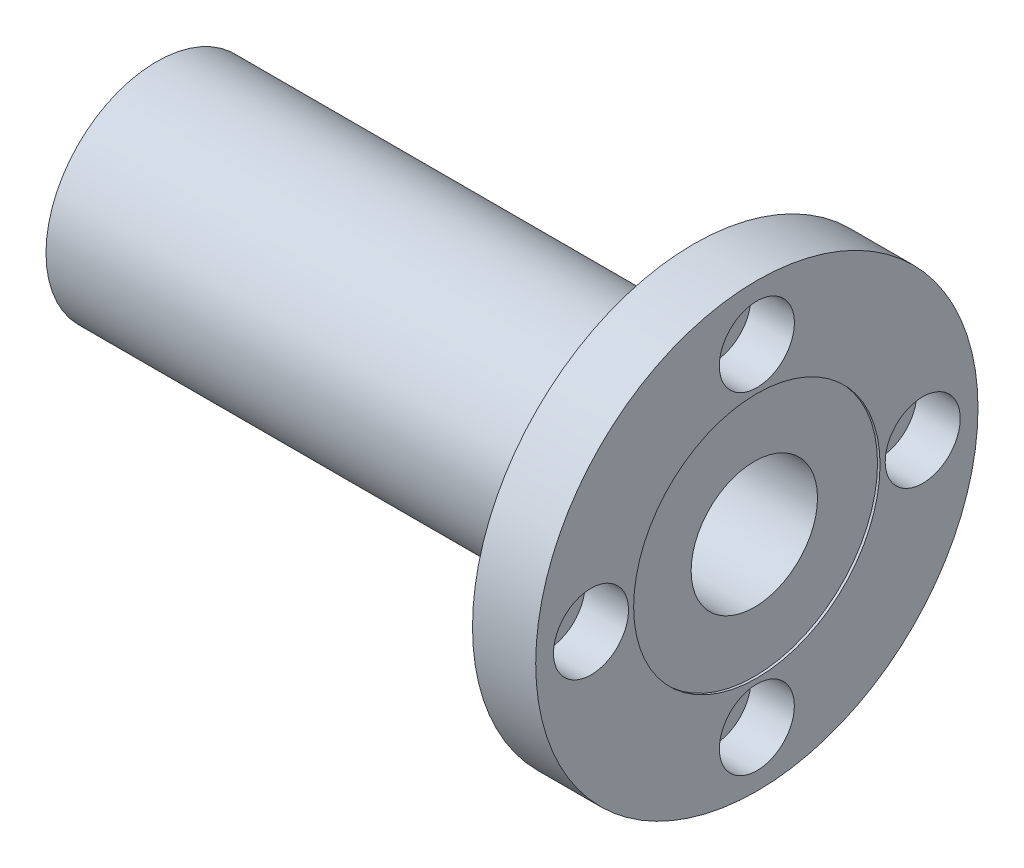
ISO-10303-21;
HEADER;
FILE_DESCRIPTION(('STEP AP214'),'2;1');
FILE_NAME('part.step','',(''),(''),'','','');
FILE_SCHEMA(('AUTOMOTIVE_DESIGN { 1 0 10303 214 1 1 1 1 }'));
ENDSEC;
DATA;
#1=APPLICATION_CONTEXT('core data for automotive mechanical design processes');
#2=APPLICATION_PROTOCOL_DEFINITION('international standard','automotive_design',2000,#1);
#3=PRODUCT_CONTEXT('',#1,'mechanical');
#4=PRODUCT('Part','Part','',(#3));
#5=PRODUCT_RELATED_PRODUCT_CATEGORY('part','',(#4));
#6=PRODUCT_DEFINITION_FORMATION('','',#4);
#7=PRODUCT_DEFINITION_CONTEXT('part definition',#1,'design');
#8=PRODUCT_DEFINITION('design','',#6,#7);
#9=PRODUCT_DEFINITION_SHAPE('','',#8);
#10=(LENGTH_UNIT() NAMED_UNIT(*) SI_UNIT(.MILLI.,.METRE.));
#11=(NAMED_UNIT(*) PLANE_ANGLE_UNIT() SI_UNIT($,.RADIAN.));
#12=(NAMED_UNIT(*) SI_UNIT($,.STERADIAN.) SOLID_ANGLE_UNIT());
#13=UNCERTAINTY_MEASURE_WITH_UNIT(LENGTH_MEASURE(1.E-05),#10,'distance_accuracy_value','');
#14=(GEOMETRIC_REPRESENTATION_CONTEXT(3) GLOBAL_UNCERTAINTY_ASSIGNED_CONTEXT((#13)) GLOBAL_UNIT_ASSIGNED_CONTEXT((#10,
#11,#12)) REPRESENTATION_CONTEXT('',''));
#15=CARTESIAN_POINT('',(0.,0.,0.));
#16=DIRECTION('',(0.,0.,1.));
#17=DIRECTION('',(1.,0.,0.));
#18=AXIS2_PLACEMENT_3D('',#15,#16,#17);
#19=CARTESIAN_POINT('',(-10.3908115950587,0.,0.));
#20=DIRECTION('',(-1.,0.,0.));
#21=DIRECTION('',(0.,0.,1.));
#22=AXIS2_PLACEMENT_3D('',#19,#20,#21);
#23=CYLINDRICAL_SURFACE('',#22,6.35000000000001);
#24=CARTESIAN_POINT('',(-30.1625,0.,0.));
#25=DIRECTION('',(-1.,0.,0.));
#26=DIRECTION('',(0.,0.,1.));
#27=AXIS2_PLACEMENT_3D('',#24,#25,#26);
#28=CIRCLE('',#27,6.35000000000001);
#29=CARTESIAN_POINT('',(-30.1625,0.,6.35000000000001));
#30=VERTEX_POINT('',#29);
#31=EDGE_CURVE('E51',#30,#30,#28,.T.);
#32=ORIENTED_EDGE('',*,*,#31,.T.);
#33=EDGE_LOOP('',(#32));
#34=FACE_BOUND('',#33,.T.);
#35=CARTESIAN_POINT('',(29.9085,0.,0.));
#36=DIRECTION('',(1.,0.,0.));
#37=DIRECTION('',(0.,0.,-1.));
#38=AXIS2_PLACEMENT_3D('',#35,#36,#37);
#39=CIRCLE('',#38,6.35000000000001);
#40=CARTESIAN_POINT('',(29.9085,0.,-6.35000000000001));
#41=VERTEX_POINT('',#40);
#42=EDGE_CURVE('E35',#41,#41,#39,.T.);
#43=ORIENTED_EDGE('',*,*,#42,.T.);
#44=EDGE_LOOP('',(#43));
#45=FACE_BOUND('',#44,.T.);
#46=ADVANCED_FACE('F31',(#34,#45),#23,.F.);
#47=CARTESIAN_POINT('',(-30.1625,-6.35000000000001,0.));
#48=DIRECTION('',(-1.,0.,0.));
#49=DIRECTION('',(0.,0.,1.));
#50=AXIS2_PLACEMENT_3D('',#47,#48,#49);
#51=PLANE('',#50);
#52=CARTESIAN_POINT('',(-30.1625,0.,0.));
#53=DIRECTION('',(-1.,0.,0.));
#54=DIRECTION('',(0.,0.,1.));
#55=AXIS2_PLACEMENT_3D('',#52,#53,#54);
#56=CIRCLE('',#55,11.1125);
#57=CARTESIAN_POINT('',(-30.1625,0.,11.1125));
#58=VERTEX_POINT('',#57);
#59=EDGE_CURVE('E10',#58,#58,#56,.T.);
#60=ORIENTED_EDGE('',*,*,#59,.T.);
#61=EDGE_LOOP('',(#60));
#62=FACE_BOUND('',#61,.T.);
#63=ORIENTED_EDGE('',*,*,#31,.F.);
#64=EDGE_LOOP('',(#63));
#65=FACE_BOUND('',#64,.T.);
#66=ADVANCED_FACE('F33',(#62,#65),#51,.T.);
#67=CARTESIAN_POINT('',(-10.3908115950587,0.,0.));
#68=DIRECTION('',(-1.,0.,0.));
#69=DIRECTION('',(0.,0.,1.));
#70=AXIS2_PLACEMENT_3D('',#67,#68,#69);
#71=CYLINDRICAL_SURFACE('',#70,11.1125);
#72=CARTESIAN_POINT('',(23.8125,0.,0.));
#73=DIRECTION('',(-1.,0.,0.));
#74=DIRECTION('',(0.,0.,1.));
#75=AXIS2_PLACEMENT_3D('',#72,#73,#74);
#76=CIRCLE('',#75,11.1125);
#77=CARTESIAN_POINT('',(23.8125,0.,11.1125));
#78=VERTEX_POINT('',#77);
#79=EDGE_CURVE('E39',#78,#78,#76,.T.);
#80=ORIENTED_EDGE('',*,*,#79,.T.);
#81=EDGE_LOOP('',(#80));
#82=FACE_BOUND('',#81,.T.);
#83=ORIENTED_EDGE('',*,*,#59,.F.);
#84=EDGE_LOOP('',(#83));
#85=FACE_BOUND('',#84,.T.);
#86=ADVANCED_FACE('F129',(#82,#85),#71,.T.);
#87=CARTESIAN_POINT('',(23.8125,-11.1125,0.));
#88=DIRECTION('',(-1.,0.,0.));
#89=DIRECTION('',(0.,0.,1.));
#90=AXIS2_PLACEMENT_3D('',#87,#88,#89);
#91=PLANE('',#90);
#92=CARTESIAN_POINT('',(23.8125,1.74595888700524E-13,-16.66875));
#93=DIRECTION('',(-1.,0.,0.));
#94=DIRECTION('',(0.,1.,0.));
#95=AXIS2_PLACEMENT_3D('',#92,#93,#94);
#96=CIRCLE('',#95,2.38125);
#97=CARTESIAN_POINT('',(23.8125,2.38125000000018,-16.66875));
#98=VERTEX_POINT('',#97);
#99=EDGE_CURVE('E90',#98,#98,#96,.T.);
#100=ORIENTED_EDGE('',*,*,#99,.F.);
#101=EDGE_LOOP('',(#100));
#102=FACE_BOUND('',#101,.T.);
#103=CARTESIAN_POINT('',(23.8125,-16.66875,-1.16397259133683E-13));
#104=DIRECTION('',(-1.,0.,0.));
#105=DIRECTION('',(0.,0.,-1.));
#106=AXIS2_PLACEMENT_3D('',#103,#104,#105);
#107=CIRCLE('',#106,2.38125);
#108=CARTESIAN_POINT('',(23.8125,-16.66875,-2.38125000000012));
#109=VERTEX_POINT('',#108);
#110=EDGE_CURVE('E78',#109,#109,#107,.T.);
#111=ORIENTED_EDGE('',*,*,#110,.F.);
#112=EDGE_LOOP('',(#111));
#113=FACE_BOUND('',#112,.T.);
#114=CARTESIAN_POINT('',(23.8125,0.,16.66875));
#115=DIRECTION('',(-1.,0.,0.));
#116=DIRECTION('',(0.,-1.,0.));
#117=AXIS2_PLACEMENT_3D('',#114,#115,#116);
#118=CIRCLE('',#117,2.38125);
#119=CARTESIAN_POINT('',(23.8125,-2.38125000000006,16.66875));
#120=VERTEX_POINT('',#119);
#121=EDGE_CURVE('E66',#120,#120,#118,.T.);
#122=ORIENTED_EDGE('',*,*,#121,.F.);
#123=EDGE_LOOP('',(#122));
#124=FACE_BOUND('',#123,.T.);
#125=CARTESIAN_POINT('',(23.8125,16.66875,0.));
#126=DIRECTION('',(-1.,0.,0.));
#127=DIRECTION('',(0.,0.,1.));
#128=AXIS2_PLACEMENT_3D('',#125,#126,#127);
#129=CIRCLE('',#128,2.38125);
#130=CARTESIAN_POINT('',(23.8125,16.66875,2.38125));
#131=VERTEX_POINT('',#130);
#132=EDGE_CURVE('E54',#131,#131,#129,.T.);
#133=ORIENTED_EDGE('',*,*,#132,.F.);
#134=EDGE_LOOP('',(#133));
#135=FACE_BOUND('',#134,.T.);
#136=CARTESIAN_POINT('',(23.8125,0.,0.));
#137=DIRECTION('',(-1.,0.,0.));
#138=DIRECTION('',(0.,0.,1.));
#139=AXIS2_PLACEMENT_3D('',#136,#137,#138);
#140=CIRCLE('',#139,22.225);
#141=CARTESIAN_POINT('',(23.8125,0.,22.225));
#142=VERTEX_POINT('',#141);
#143=EDGE_CURVE('E43',#142,#142,#140,.T.);
#144=ORIENTED_EDGE('',*,*,#143,.T.);
#145=EDGE_LOOP('',(#144));
#146=FACE_BOUND('',#145,.T.);
#147=ORIENTED_EDGE('',*,*,#79,.F.);
#148=EDGE_LOOP('',(#147));
#149=FACE_BOUND('',#148,.T.);
#150=ADVANCED_FACE('F141',(#102,#113,#124,#135,#146,#149),#91,.T.);
#151=CARTESIAN_POINT('',(-10.3908115950587,0.,0.));
#152=DIRECTION('',(-1.,0.,0.));
#153=DIRECTION('',(0.,0.,1.));
#154=AXIS2_PLACEMENT_3D('',#151,#152,#153);
#155=CYLINDRICAL_SURFACE('',#154,22.225);
#156=CARTESIAN_POINT('',(30.1625,0.,0.));
#157=DIRECTION('',(-1.,0.,0.));
#158=DIRECTION('',(0.,0.,1.));
#159=AXIS2_PLACEMENT_3D('',#156,#157,#158);
#160=CIRCLE('',#159,22.225);
#161=CARTESIAN_POINT('',(30.1625,0.,22.225));
#162=VERTEX_POINT('',#161);
#163=EDGE_CURVE('E48',#162,#162,#160,.T.);
#164=ORIENTED_EDGE('',*,*,#163,.T.);
#165=EDGE_LOOP('',(#164));
#166=FACE_BOUND('',#165,.T.);
#167=ORIENTED_EDGE('',*,*,#143,.F.);
#168=EDGE_LOOP('',(#167));
#169=FACE_BOUND('',#168,.T.);
#170=ADVANCED_FACE('F137',(#166,#169),#155,.T.);
#171=CARTESIAN_POINT('',(30.1625,-22.225,0.));
#172=DIRECTION('',(1.,0.,0.));
#173=DIRECTION('',(0.,0.,-1.));
#174=AXIS2_PLACEMENT_3D('',#171,#172,#173);
#175=PLANE('',#174);
#176=CARTESIAN_POINT('',(30.1625,0.,0.));
#177=DIRECTION('',(1.,0.,0.));
#178=DIRECTION('',(0.,0.,-1.));
#179=AXIS2_PLACEMENT_3D('',#176,#177,#178);
#180=CIRCLE('',#179,12.3825);
#181=CARTESIAN_POINT('',(30.1625,0.,-12.3825));
#182=VERTEX_POINT('',#181);
#183=EDGE_CURVE('E102',#182,#182,#180,.T.);
#184=ORIENTED_EDGE('',*,*,#183,.F.);
#185=EDGE_LOOP('',(#184));
#186=FACE_BOUND('',#185,.T.);
#187=CARTESIAN_POINT('',(30.1625,1.74595888700524E-13,-16.66875));
#188=DIRECTION('',(-1.,0.,0.));
#189=DIRECTION('',(0.,1.,0.));
#190=AXIS2_PLACEMENT_3D('',#187,#188,#189);
#191=CIRCLE('',#190,3.77063);
#192=CARTESIAN_POINT('',(30.1625,3.77063000000017,-16.66875));
#193=VERTEX_POINT('',#192);
#194=EDGE_CURVE('E99',#193,#193,#191,.T.);
#195=ORIENTED_EDGE('',*,*,#194,.T.);
#196=EDGE_LOOP('',(#195));
#197=FACE_BOUND('',#196,.T.);
#198=CARTESIAN_POINT('',(30.1625,-16.66875,-1.16397259133683E-13));
#199=DIRECTION('',(-1.,0.,0.));
#200=DIRECTION('',(0.,0.,-1.));
#201=AXIS2_PLACEMENT_3D('',#198,#199,#200);
#202=CIRCLE('',#201,3.77063);
#203=CARTESIAN_POINT('',(30.1625,-16.66875,-3.77063000000011));
#204=VERTEX_POINT('',#203);
#205=EDGE_CURVE('E87',#204,#204,#202,.T.);
#206=ORIENTED_EDGE('',*,*,#205,.T.);
#207=EDGE_LOOP('',(#206));
#208=FACE_BOUND('',#207,.T.);
#209=CARTESIAN_POINT('',(30.1625,0.,16.66875));
#210=DIRECTION('',(-1.,0.,0.));
#211=DIRECTION('',(0.,-1.,0.));
#212=AXIS2_PLACEMENT_3D('',#209,#210,#211);
#213=CIRCLE('',#212,3.77063);
#214=CARTESIAN_POINT('',(30.1625,-3.77063000000006,16.66875));
#215=VERTEX_POINT('',#214);
#216=EDGE_CURVE('E75',#215,#215,#213,.T.);
#217=ORIENTED_EDGE('',*,*,#216,.T.);
#218=EDGE_LOOP('',(#217));
#219=FACE_BOUND('',#218,.T.);
#220=CARTESIAN_POINT('',(30.1625,16.66875,0.));
#221=DIRECTION('',(-1.,0.,0.));
#222=DIRECTION('',(0.,0.,1.));
#223=AXIS2_PLACEMENT_3D('',#220,#221,#222);
#224=CIRCLE('',#223,3.77063);
#225=CARTESIAN_POINT('',(30.1625,16.66875,3.77063));
#226=VERTEX_POINT('',#225);
#227=EDGE_CURVE('E63',#226,#226,#224,.T.);
#228=ORIENTED_EDGE('',*,*,#227,.T.);
#229=EDGE_LOOP('',(#228));
#230=FACE_BOUND('',#229,.T.);
#231=ORIENTED_EDGE('',*,*,#163,.F.);
#232=EDGE_LOOP('',(#231));
#233=FACE_BOUND('',#232,.T.);
#234=ADVANCED_FACE('F134',(#186,#197,#208,#219,#230,#233),#175,.T.);
#235=CARTESIAN_POINT('',(7.20532024776216,16.66875,0.));
#236=DIRECTION('',(-1.,0.,0.));
#237=DIRECTION('',(0.,0.,1.));
#238=AXIS2_PLACEMENT_3D('',#235,#236,#237);
#239=CYLINDRICAL_SURFACE('',#238,2.38125);
#240=ORIENTED_EDGE('',*,*,#132,.T.);
#241=EDGE_LOOP('',(#240));
#242=FACE_BOUND('',#241,.T.);
#243=CARTESIAN_POINT('',(25.79624,16.66875,0.));
#244=DIRECTION('',(-1.,0.,0.));
#245=DIRECTION('',(0.,0.,1.));
#246=AXIS2_PLACEMENT_3D('',#243,#244,#245);
#247=CIRCLE('',#246,2.38125);
#248=CARTESIAN_POINT('',(25.79624,16.66875,2.38125));
#249=VERTEX_POINT('',#248);
#250=EDGE_CURVE('E57',#249,#249,#247,.T.);
#251=ORIENTED_EDGE('',*,*,#250,.F.);
#252=EDGE_LOOP('',(#251));
#253=FACE_BOUND('',#252,.T.);
#254=ADVANCED_FACE('F132',(#242,#253),#239,.F.);
#255=CARTESIAN_POINT('',(25.79624,20.43938,0.));
#256=DIRECTION('',(1.,0.,0.));
#257=DIRECTION('',(0.,0.,-1.));
#258=AXIS2_PLACEMENT_3D('',#255,#256,#257);
#259=PLANE('',#258);
#260=ORIENTED_EDGE('',*,*,#250,.T.);
#261=EDGE_LOOP('',(#260));
#262=FACE_BOUND('',#261,.T.);
#263=CARTESIAN_POINT('',(25.79624,16.66875,0.));
#264=DIRECTION('',(-1.,0.,0.));
#265=DIRECTION('',(0.,0.,1.));
#266=AXIS2_PLACEMENT_3D('',#263,#264,#265);
#267=CIRCLE('',#266,3.77063);
#268=CARTESIAN_POINT('',(25.79624,16.66875,3.77063));
#269=VERTEX_POINT('',#268);
#270=EDGE_CURVE('E60',#269,#269,#267,.T.);
#271=ORIENTED_EDGE('',*,*,#270,.F.);
#272=EDGE_LOOP('',(#271));
#273=FACE_BOUND('',#272,.T.);
#274=ADVANCED_FACE('F175',(#262,#273),#259,.T.);
#275=CARTESIAN_POINT('',(7.20532024776216,16.66875,0.));
#276=DIRECTION('',(-1.,0.,0.));
#277=DIRECTION('',(0.,0.,1.));
#278=AXIS2_PLACEMENT_3D('',#275,#276,#277);
#279=CYLINDRICAL_SURFACE('',#278,3.77063);
#280=ORIENTED_EDGE('',*,*,#270,.T.);
#281=EDGE_LOOP('',(#280));
#282=FACE_BOUND('',#281,.T.);
#283=ORIENTED_EDGE('',*,*,#227,.F.);
#284=EDGE_LOOP('',(#283));
#285=FACE_BOUND('',#284,.T.);
#286=ADVANCED_FACE('F182',(#282,#285),#279,.F.);
#287=CARTESIAN_POINT('',(7.20532024776216,0.,16.66875));
#288=DIRECTION('',(-1.,0.,0.));
#289=DIRECTION('',(0.,-1.,0.));
#290=AXIS2_PLACEMENT_3D('',#287,#288,#289);
#291=CYLINDRICAL_SURFACE('',#290,2.38125);
#292=ORIENTED_EDGE('',*,*,#121,.T.);
#293=EDGE_LOOP('',(#292));
#294=FACE_BOUND('',#293,.T.);
#295=CARTESIAN_POINT('',(25.79624,0.,16.66875));
#296=DIRECTION('',(-1.,0.,0.));
#297=DIRECTION('',(0.,-1.,0.));
#298=AXIS2_PLACEMENT_3D('',#295,#296,#297);
#299=CIRCLE('',#298,2.38125);
#300=CARTESIAN_POINT('',(25.79624,-2.38125000000006,16.66875));
#301=VERTEX_POINT('',#300);
#302=EDGE_CURVE('E69',#301,#301,#299,.T.);
#303=ORIENTED_EDGE('',*,*,#302,.F.);
#304=EDGE_LOOP('',(#303));
#305=FACE_BOUND('',#304,.T.);
#306=ADVANCED_FACE('F188',(#294,#305),#291,.F.);
#307=CARTESIAN_POINT('',(25.79624,0.,20.43938));
#308=DIRECTION('',(1.,0.,0.));
#309=DIRECTION('',(0.,1.,0.));
#310=AXIS2_PLACEMENT_3D('',#307,#308,#309);
#311=PLANE('',#310);
#312=ORIENTED_EDGE('',*,*,#302,.T.);
#313=EDGE_LOOP('',(#312));
#314=FACE_BOUND('',#313,.T.);
#315=CARTESIAN_POINT('',(25.79624,0.,16.66875));
#316=DIRECTION('',(-1.,0.,0.));
#317=DIRECTION('',(0.,-1.,0.));
#318=AXIS2_PLACEMENT_3D('',#315,#316,#317);
#319=CIRCLE('',#318,3.77063);
#320=CARTESIAN_POINT('',(25.79624,-3.77063000000006,16.66875));
#321=VERTEX_POINT('',#320);
#322=EDGE_CURVE('E72',#321,#321,#319,.T.);
#323=ORIENTED_EDGE('',*,*,#322,.F.);
#324=EDGE_LOOP('',(#323));
#325=FACE_BOUND('',#324,.T.);
#326=ADVANCED_FACE('F195',(#314,#325),#311,.T.);
#327=CARTESIAN_POINT('',(7.20532024776216,0.,16.66875));
#328=DIRECTION('',(-1.,0.,0.));
#329=DIRECTION('',(0.,-1.,0.));
#330=AXIS2_PLACEMENT_3D('',#327,#328,#329);
#331=CYLINDRICAL_SURFACE('',#330,3.77063);
#332=ORIENTED_EDGE('',*,*,#322,.T.);
#333=EDGE_LOOP('',(#332));
#334=FACE_BOUND('',#333,.T.);
#335=ORIENTED_EDGE('',*,*,#216,.F.);
#336=EDGE_LOOP('',(#335));
#337=FACE_BOUND('',#336,.T.);
#338=ADVANCED_FACE('F203',(#334,#337),#331,.F.);
#339=CARTESIAN_POINT('',(7.20532024776216,-16.66875,-1.16397259133683E-13));
#340=DIRECTION('',(-1.,0.,0.));
#341=DIRECTION('',(0.,0.,-1.));
#342=AXIS2_PLACEMENT_3D('',#339,#340,#341);
#343=CYLINDRICAL_SURFACE('',#342,2.38125);
#344=ORIENTED_EDGE('',*,*,#110,.T.);
#345=EDGE_LOOP('',(#344));
#346=FACE_BOUND('',#345,.T.);
#347=CARTESIAN_POINT('',(25.79624,-16.66875,-1.16397259133683E-13));
#348=DIRECTION('',(-1.,0.,0.));
#349=DIRECTION('',(0.,0.,-1.));
#350=AXIS2_PLACEMENT_3D('',#347,#348,#349);
#351=CIRCLE('',#350,2.38125);
#352=CARTESIAN_POINT('',(25.79624,-16.66875,-2.38125000000012));
#353=VERTEX_POINT('',#352);
#354=EDGE_CURVE('E81',#353,#353,#351,.T.);
#355=ORIENTED_EDGE('',*,*,#354,.F.);
#356=EDGE_LOOP('',(#355));
#357=FACE_BOUND('',#356,.T.);
#358=ADVANCED_FACE('F211',(#346,#357),#343,.F.);
#359=CARTESIAN_POINT('',(25.79624,-20.43938,-1.42727427695047E-13));
#360=DIRECTION('',(1.,0.,0.));
#361=DIRECTION('',(0.,0.,1.));
#362=AXIS2_PLACEMENT_3D('',#359,#360,#361);
#363=PLANE('',#362);
#364=ORIENTED_EDGE('',*,*,#354,.T.);
#365=EDGE_LOOP('',(#364));
#366=FACE_BOUND('',#365,.T.);
#367=CARTESIAN_POINT('',(25.79624,-16.66875,-1.16397259133683E-13));
#368=DIRECTION('',(-1.,0.,0.));
#369=DIRECTION('',(0.,0.,-1.));
#370=AXIS2_PLACEMENT_3D('',#367,#368,#369);
#371=CIRCLE('',#370,3.77063);
#372=CARTESIAN_POINT('',(25.79624,-16.66875,-3.77063000000011));
#373=VERTEX_POINT('',#372);
#374=EDGE_CURVE('E84',#373,#373,#371,.T.);
#375=ORIENTED_EDGE('',*,*,#374,.F.);
#376=EDGE_LOOP('',(#375));
#377=FACE_BOUND('',#376,.T.);
#378=ADVANCED_FACE('F219',(#366,#377),#363,.T.);
#379=CARTESIAN_POINT('',(7.20532024776216,-16.66875,-1.16397259133683E-13));
#380=DIRECTION('',(-1.,0.,0.));
#381=DIRECTION('',(0.,0.,-1.));
#382=AXIS2_PLACEMENT_3D('',#379,#380,#381);
#383=CYLINDRICAL_SURFACE('',#382,3.77063);
#384=ORIENTED_EDGE('',*,*,#374,.T.);
#385=EDGE_LOOP('',(#384));
#386=FACE_BOUND('',#385,.T.);
#387=ORIENTED_EDGE('',*,*,#205,.F.);
#388=EDGE_LOOP('',(#387));
#389=FACE_BOUND('',#388,.T.);
#390=ADVANCED_FACE('F227',(#386,#389),#383,.F.);
#391=CARTESIAN_POINT('',(7.20532024776216,1.74595888700524E-13,-16.66875));
#392=DIRECTION('',(-1.,0.,0.));
#393=DIRECTION('',(0.,1.,0.));
#394=AXIS2_PLACEMENT_3D('',#391,#392,#393);
#395=CYLINDRICAL_SURFACE('',#394,2.38125);
#396=ORIENTED_EDGE('',*,*,#99,.T.);
#397=EDGE_LOOP('',(#396));
#398=FACE_BOUND('',#397,.T.);
#399=CARTESIAN_POINT('',(25.79624,1.74595888700524E-13,-16.66875));
#400=DIRECTION('',(-1.,0.,0.));
#401=DIRECTION('',(0.,1.,0.));
#402=AXIS2_PLACEMENT_3D('',#399,#400,#401);
#403=CIRCLE('',#402,2.38125);
#404=CARTESIAN_POINT('',(25.79624,2.38125000000018,-16.66875));
#405=VERTEX_POINT('',#404);
#406=EDGE_CURVE('E93',#405,#405,#403,.T.);
#407=ORIENTED_EDGE('',*,*,#406,.F.);
#408=EDGE_LOOP('',(#407));
#409=FACE_BOUND('',#408,.T.);
#410=ADVANCED_FACE('F235',(#398,#409),#395,.F.);
#411=CARTESIAN_POINT('',(25.79624,2.14091141542571E-13,-20.43938));
#412=DIRECTION('',(1.,0.,0.));
#413=DIRECTION('',(0.,-1.,0.));
#414=AXIS2_PLACEMENT_3D('',#411,#412,#413);
#415=PLANE('',#414);
#416=ORIENTED_EDGE('',*,*,#406,.T.);
#417=EDGE_LOOP('',(#416));
#418=FACE_BOUND('',#417,.T.);
#419=CARTESIAN_POINT('',(25.79624,1.74595888700524E-13,-16.66875));
#420=DIRECTION('',(-1.,0.,0.));
#421=DIRECTION('',(0.,1.,0.));
#422=AXIS2_PLACEMENT_3D('',#419,#420,#421);
#423=CIRCLE('',#422,3.77063);
#424=CARTESIAN_POINT('',(25.79624,3.77063000000017,-16.66875));
#425=VERTEX_POINT('',#424);
#426=EDGE_CURVE('E96',#425,#425,#423,.T.);
#427=ORIENTED_EDGE('',*,*,#426,.F.);
#428=EDGE_LOOP('',(#427));
#429=FACE_BOUND('',#428,.T.);
#430=ADVANCED_FACE('F243',(#418,#429),#415,.T.);
#431=CARTESIAN_POINT('',(7.20532024776216,1.74595888700524E-13,-16.66875));
#432=DIRECTION('',(-1.,0.,0.));
#433=DIRECTION('',(0.,1.,0.));
#434=AXIS2_PLACEMENT_3D('',#431,#432,#433);
#435=CYLINDRICAL_SURFACE('',#434,3.77063);
#436=ORIENTED_EDGE('',*,*,#426,.T.);
#437=EDGE_LOOP('',(#436));
#438=FACE_BOUND('',#437,.T.);
#439=ORIENTED_EDGE('',*,*,#194,.F.);
#440=EDGE_LOOP('',(#439));
#441=FACE_BOUND('',#440,.T.);
#442=ADVANCED_FACE('F120',(#438,#441),#435,.F.);
#443=CARTESIAN_POINT('',(29.9085,0.,0.));
#444=DIRECTION('',(1.,0.,0.));
#445=DIRECTION('',(0.,0.,-1.));
#446=AXIS2_PLACEMENT_3D('',#443,#444,#445);
#447=CYLINDRICAL_SURFACE('',#446,12.3825);
#448=CARTESIAN_POINT('',(29.9085,0.,0.));
#449=DIRECTION('',(1.,0.,0.));
#450=DIRECTION('',(0.,0.,-1.));
#451=AXIS2_PLACEMENT_3D('',#448,#449,#450);
#452=CIRCLE('',#451,12.3825);
#453=CARTESIAN_POINT('',(29.9085,0.,-12.3825));
#454=VERTEX_POINT('',#453);
#455=EDGE_CURVE('E105',#454,#454,#452,.T.);
#456=ORIENTED_EDGE('',*,*,#455,.F.);
#457=EDGE_LOOP('',(#456));
#458=FACE_BOUND('',#457,.T.);
#459=ORIENTED_EDGE('',*,*,#183,.T.);
#460=EDGE_LOOP('',(#459));
#461=FACE_BOUND('',#460,.T.);
#462=ADVANCED_FACE('F115',(#458,#461),#447,.F.);
#463=CARTESIAN_POINT('',(29.9085,0.,0.));
#464=DIRECTION('',(1.,0.,0.));
#465=DIRECTION('',(0.,0.,-1.));
#466=AXIS2_PLACEMENT_3D('',#463,#464,#465);
#467=PLANE('',#466);
#468=ORIENTED_EDGE('',*,*,#42,.F.);
#469=EDGE_LOOP('',(#468));
#470=FACE_BOUND('',#469,.T.);
#471=ORIENTED_EDGE('',*,*,#455,.T.);
#472=EDGE_LOOP('',(#471));
#473=FACE_BOUND('',#472,.T.);
#474=ADVANCED_FACE('F113',(#470,#473),#467,.T.);
#475=CLOSED_SHELL('',(#46,#66,#86,#150,#170,#234,#254,#274,#286,#306,#326,#338,#358,#378,#390,
#410,#430,#442,#462,#474));
#476=MANIFOLD_SOLID_BREP('B2',#475);
#477=ADVANCED_BREP_SHAPE_REPRESENTATION('',(#18,#476),#14);
#478=SHAPE_DEFINITION_REPRESENTATION(#9,#477);
ENDSEC;
END-ISO-10303-21;
